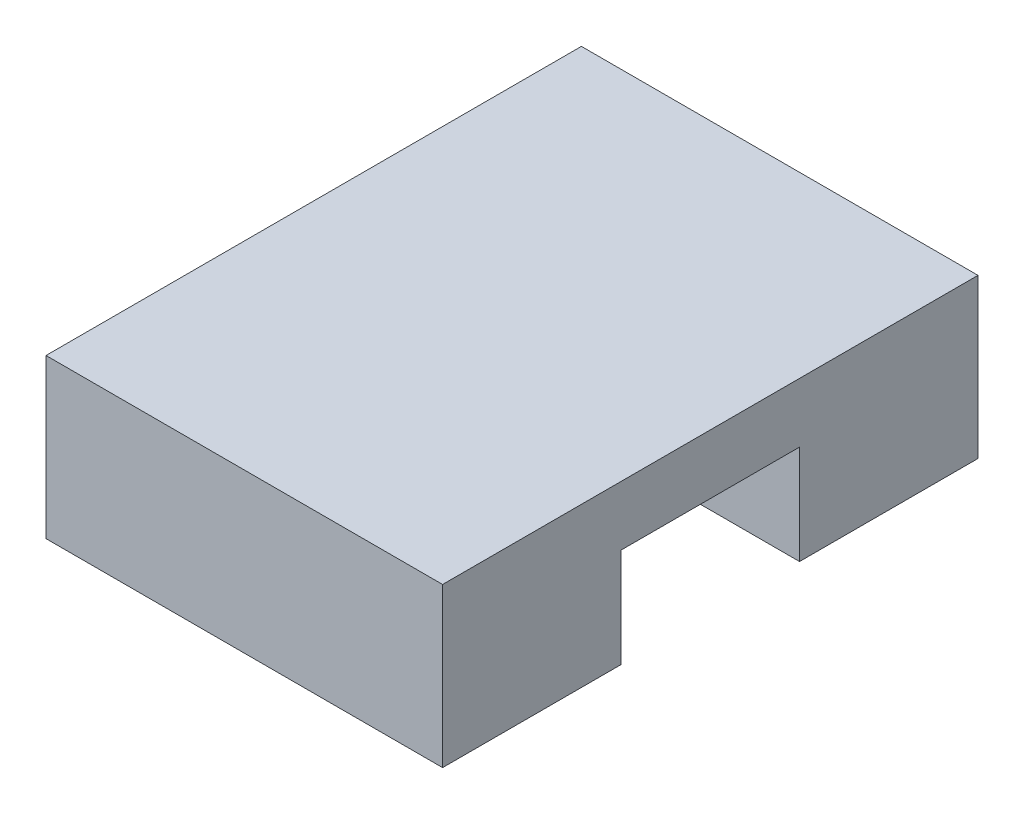
ISO-10303-21;
HEADER;
FILE_DESCRIPTION(('STEP AP214'),'2;1');
FILE_NAME('part.step','',(''),(''),'','','');
FILE_SCHEMA(('AUTOMOTIVE_DESIGN { 1 0 10303 214 1 1 1 1 }'));
ENDSEC;
DATA;
#1=APPLICATION_CONTEXT('core data for automotive mechanical design processes');
#2=APPLICATION_PROTOCOL_DEFINITION('international standard','automotive_design',2000,#1);
#3=PRODUCT_CONTEXT('',#1,'mechanical');
#4=PRODUCT('Part','Part','',(#3));
#5=PRODUCT_RELATED_PRODUCT_CATEGORY('part','',(#4));
#6=PRODUCT_DEFINITION_FORMATION('','',#4);
#7=PRODUCT_DEFINITION_CONTEXT('part definition',#1,'design');
#8=PRODUCT_DEFINITION('design','',#6,#7);
#9=PRODUCT_DEFINITION_SHAPE('','',#8);
#10=(LENGTH_UNIT() NAMED_UNIT(*) SI_UNIT(.MILLI.,.METRE.));
#11=(NAMED_UNIT(*) PLANE_ANGLE_UNIT() SI_UNIT($,.RADIAN.));
#12=(NAMED_UNIT(*) SI_UNIT($,.STERADIAN.) SOLID_ANGLE_UNIT());
#13=UNCERTAINTY_MEASURE_WITH_UNIT(LENGTH_MEASURE(1.E-05),#10,'distance_accuracy_value','');
#14=(GEOMETRIC_REPRESENTATION_CONTEXT(3) GLOBAL_UNCERTAINTY_ASSIGNED_CONTEXT((#13)) GLOBAL_UNIT_ASSIGNED_CONTEXT((#10,
#11,#12)) REPRESENTATION_CONTEXT('',''));
#15=CARTESIAN_POINT('',(0.,0.,0.));
#16=DIRECTION('',(0.,0.,1.));
#17=DIRECTION('',(1.,0.,0.));
#18=AXIS2_PLACEMENT_3D('',#15,#16,#17);
#19=CARTESIAN_POINT('',(0.,0.,0.));
#20=DIRECTION('',(0.,1.,0.));
#21=DIRECTION('',(0.,0.,1.));
#22=AXIS2_PLACEMENT_3D('',#19,#20,#21);
#23=PLANE('',#22);
#24=DIRECTION('',(0.,0.,-1.));
#25=VECTOR('',#24,1.);
#26=CARTESIAN_POINT('',(-0.903225806451618,0.,-9.87096774193548));
#27=LINE('',#26,#25);
#28=CARTESIAN_POINT('',(-0.903225806451614,0.,-0.870967741935486));
#29=VERTEX_POINT('',#28);
#30=CARTESIAN_POINT('',(-0.903225806451618,0.,-9.87096774193548));
#31=VERTEX_POINT('',#30);
#32=EDGE_CURVE('E132',#29,#31,#27,.T.);
#33=ORIENTED_EDGE('',*,*,#32,.F.);
#34=DIRECTION('',(-1.,0.,0.));
#35=VECTOR('',#34,1.);
#36=CARTESIAN_POINT('',(-0.903225806451614,0.,-0.870967741935486));
#37=LINE('',#36,#35);
#38=CARTESIAN_POINT('',(-20.9032258064516,0.,-0.870967741935484));
#39=VERTEX_POINT('',#38);
#40=EDGE_CURVE('E114',#29,#39,#37,.T.);
#41=ORIENTED_EDGE('',*,*,#40,.T.);
#42=DIRECTION('',(0.,0.,1.));
#43=VECTOR('',#42,1.);
#44=CARTESIAN_POINT('',(-20.9032258064516,0.,-9.87096774193548));
#45=LINE('',#44,#43);
#46=CARTESIAN_POINT('',(-20.9032258064516,0.,-9.87096774193548));
#47=VERTEX_POINT('',#46);
#48=EDGE_CURVE('E144',#47,#39,#45,.T.);
#49=ORIENTED_EDGE('',*,*,#48,.F.);
#50=DIRECTION('',(-1.,0.,0.));
#51=VECTOR('',#50,1.);
#52=CARTESIAN_POINT('',(-20.9032258064516,0.,-9.87096774193548));
#53=LINE('',#52,#51);
#54=EDGE_CURVE('E85',#31,#47,#53,.T.);
#55=ORIENTED_EDGE('',*,*,#54,.F.);
#56=EDGE_LOOP('',(#33,#41,#49,#55));
#57=FACE_BOUND('',#56,.T.);
#58=ADVANCED_FACE('F39',(#57),#23,.F.);
#59=CARTESIAN_POINT('',(-20.9032258064516,8.,-9.87096774193548));
#60=DIRECTION('',(1.,0.,0.));
#61=DIRECTION('',(0.,0.,-1.));
#62=AXIS2_PLACEMENT_3D('',#59,#60,#61);
#63=PLANE('',#62);
#64=ORIENTED_EDGE('',*,*,#48,.T.);
#65=DIRECTION('',(0.,-1.,0.));
#66=VECTOR('',#65,1.);
#67=CARTESIAN_POINT('',(-20.9032258064516,5.,-0.870967741935485));
#68=LINE('',#67,#66);
#69=CARTESIAN_POINT('',(-20.9032258064516,5.,-0.870967741935485));
#70=VERTEX_POINT('',#69);
#71=EDGE_CURVE('E120',#70,#39,#68,.T.);
#72=ORIENTED_EDGE('',*,*,#71,.F.);
#73=DIRECTION('',(0.,0.,-1.));
#74=VECTOR('',#73,1.);
#75=CARTESIAN_POINT('',(-20.9032258064516,5.,-0.870967741935485));
#76=LINE('',#75,#74);
#77=CARTESIAN_POINT('',(-20.9032258064516,5.,8.12903225806452));
#78=VERTEX_POINT('',#77);
#79=EDGE_CURVE('E135',#78,#70,#76,.T.);
#80=ORIENTED_EDGE('',*,*,#79,.F.);
#81=DIRECTION('',(0.,1.,0.));
#82=VECTOR('',#81,1.);
#83=CARTESIAN_POINT('',(-20.9032258064516,5.,8.12903225806452));
#84=LINE('',#83,#82);
#85=CARTESIAN_POINT('',(-20.9032258064516,0.,8.12903225806452));
#86=VERTEX_POINT('',#85);
#87=EDGE_CURVE('E192',#86,#78,#84,.T.);
#88=ORIENTED_EDGE('',*,*,#87,.F.);
#89=CARTESIAN_POINT('',(-20.9032258064516,0.,17.1290322580645));
#90=VERTEX_POINT('',#89);
#91=EDGE_CURVE('E165',#86,#90,#45,.T.);
#92=ORIENTED_EDGE('',*,*,#91,.T.);
#93=DIRECTION('',(0.,-1.,0.));
#94=VECTOR('',#93,1.);
#95=CARTESIAN_POINT('',(-20.9032258064516,8.,17.1290322580645));
#96=LINE('',#95,#94);
#97=CARTESIAN_POINT('',(-20.9032258064516,8.,17.1290322580645));
#98=VERTEX_POINT('',#97);
#99=EDGE_CURVE('E11',#98,#90,#96,.T.);
#100=ORIENTED_EDGE('',*,*,#99,.F.);
#101=DIRECTION('',(0.,0.,1.));
#102=VECTOR('',#101,1.);
#103=CARTESIAN_POINT('',(-20.9032258064516,8.,-9.87096774193548));
#104=LINE('',#103,#102);
#105=CARTESIAN_POINT('',(-20.9032258064516,8.,-9.87096774193548));
#106=VERTEX_POINT('',#105);
#107=EDGE_CURVE('E150',#106,#98,#104,.T.);
#108=ORIENTED_EDGE('',*,*,#107,.F.);
#109=DIRECTION('',(0.,-1.,0.));
#110=VECTOR('',#109,1.);
#111=CARTESIAN_POINT('',(-20.9032258064516,8.,-9.87096774193548));
#112=LINE('',#111,#110);
#113=EDGE_CURVE('E151',#106,#47,#112,.T.);
#114=ORIENTED_EDGE('',*,*,#113,.T.);
#115=EDGE_LOOP('',(#64,#72,#80,#88,#92,#100,#108,#114));
#116=FACE_BOUND('',#115,.T.);
#117=ADVANCED_FACE('F41',(#116),#63,.F.);
#118=CARTESIAN_POINT('',(-20.9032258064516,8.,17.1290322580645));
#119=DIRECTION('',(0.,0.,-1.));
#120=DIRECTION('',(-1.,0.,0.));
#121=AXIS2_PLACEMENT_3D('',#118,#119,#120);
#122=PLANE('',#121);
#123=DIRECTION('',(1.,0.,0.));
#124=VECTOR('',#123,1.);
#125=CARTESIAN_POINT('',(-20.9032258064516,0.,17.1290322580645));
#126=LINE('',#125,#124);
#127=CARTESIAN_POINT('',(-0.903225806451615,0.,17.1290322580645));
#128=VERTEX_POINT('',#127);
#129=EDGE_CURVE('E139',#90,#128,#126,.T.);
#130=ORIENTED_EDGE('',*,*,#129,.T.);
#131=DIRECTION('',(0.,-1.,0.));
#132=VECTOR('',#131,1.);
#133=CARTESIAN_POINT('',(-0.903225806451615,8.,17.1290322580645));
#134=LINE('',#133,#132);
#135=CARTESIAN_POINT('',(-0.903225806451615,8.,17.1290322580645));
#136=VERTEX_POINT('',#135);
#137=EDGE_CURVE('E48',#136,#128,#134,.T.);
#138=ORIENTED_EDGE('',*,*,#137,.F.);
#139=DIRECTION('',(1.,0.,0.));
#140=VECTOR('',#139,1.);
#141=CARTESIAN_POINT('',(-20.9032258064516,8.,17.1290322580645));
#142=LINE('',#141,#140);
#143=EDGE_CURVE('E92',#98,#136,#142,.T.);
#144=ORIENTED_EDGE('',*,*,#143,.F.);
#145=ORIENTED_EDGE('',*,*,#99,.T.);
#146=EDGE_LOOP('',(#130,#138,#144,#145));
#147=FACE_BOUND('',#146,.T.);
#148=ADVANCED_FACE('F217',(#147),#122,.F.);
#149=CARTESIAN_POINT('',(-0.903225806451618,8.,-9.87096774193548));
#150=DIRECTION('',(-1.,0.,0.));
#151=DIRECTION('',(0.,0.,1.));
#152=AXIS2_PLACEMENT_3D('',#149,#150,#151);
#153=PLANE('',#152);
#154=DIRECTION('',(0.,0.,-1.));
#155=VECTOR('',#154,1.);
#156=CARTESIAN_POINT('',(-0.903225806451614,5.,-0.870967741935487));
#157=LINE('',#156,#155);
#158=CARTESIAN_POINT('',(-0.903225806451614,5.,8.12903225806451));
#159=VERTEX_POINT('',#158);
#160=CARTESIAN_POINT('',(-0.903225806451614,5.,-0.870967741935487));
#161=VERTEX_POINT('',#160);
#162=EDGE_CURVE('E127',#159,#161,#157,.T.);
#163=ORIENTED_EDGE('',*,*,#162,.T.);
#164=DIRECTION('',(0.,-1.,0.));
#165=VECTOR('',#164,1.);
#166=CARTESIAN_POINT('',(-0.903225806451614,5.,-0.870967741935487));
#167=LINE('',#166,#165);
#168=EDGE_CURVE('E117',#161,#29,#167,.T.);
#169=ORIENTED_EDGE('',*,*,#168,.T.);
#170=ORIENTED_EDGE('',*,*,#32,.T.);
#171=DIRECTION('',(0.,-1.,0.));
#172=VECTOR('',#171,1.);
#173=CARTESIAN_POINT('',(-0.903225806451618,8.,-9.87096774193548));
#174=LINE('',#173,#172);
#175=CARTESIAN_POINT('',(-0.903225806451618,8.,-9.87096774193548));
#176=VERTEX_POINT('',#175);
#177=EDGE_CURVE('E154',#176,#31,#174,.T.);
#178=ORIENTED_EDGE('',*,*,#177,.F.);
#179=DIRECTION('',(0.,0.,-1.));
#180=VECTOR('',#179,1.);
#181=CARTESIAN_POINT('',(-0.903225806451618,8.,-9.87096774193548));
#182=LINE('',#181,#180);
#183=EDGE_CURVE('E160',#136,#176,#182,.T.);
#184=ORIENTED_EDGE('',*,*,#183,.F.);
#185=ORIENTED_EDGE('',*,*,#137,.T.);
#186=CARTESIAN_POINT('',(-0.903225806451616,0.,8.12903225806452));
#187=VERTEX_POINT('',#186);
#188=EDGE_CURVE('E138',#128,#187,#27,.T.);
#189=ORIENTED_EDGE('',*,*,#188,.T.);
#190=DIRECTION('',(0.,1.,0.));
#191=VECTOR('',#190,1.);
#192=CARTESIAN_POINT('',(-0.903225806451614,5.,8.12903225806451));
#193=LINE('',#192,#191);
#194=EDGE_CURVE('E55',#187,#159,#193,.T.);
#195=ORIENTED_EDGE('',*,*,#194,.T.);
#196=EDGE_LOOP('',(#163,#169,#170,#178,#184,#185,#189,#195));
#197=FACE_BOUND('',#196,.T.);
#198=ADVANCED_FACE('F130',(#197),#153,.F.);
#199=CARTESIAN_POINT('',(-20.9032258064516,8.,-9.87096774193548));
#200=DIRECTION('',(0.,0.,1.));
#201=DIRECTION('',(1.,0.,0.));
#202=AXIS2_PLACEMENT_3D('',#199,#200,#201);
#203=PLANE('',#202);
#204=ORIENTED_EDGE('',*,*,#54,.T.);
#205=ORIENTED_EDGE('',*,*,#113,.F.);
#206=DIRECTION('',(-1.,0.,0.));
#207=VECTOR('',#206,1.);
#208=CARTESIAN_POINT('',(-20.9032258064516,8.,-9.87096774193548));
#209=LINE('',#208,#207);
#210=EDGE_CURVE('E64',#176,#106,#209,.T.);
#211=ORIENTED_EDGE('',*,*,#210,.F.);
#212=ORIENTED_EDGE('',*,*,#177,.T.);
#213=EDGE_LOOP('',(#204,#205,#211,#212));
#214=FACE_BOUND('',#213,.T.);
#215=ADVANCED_FACE('F225',(#214),#203,.F.);
#216=CARTESIAN_POINT('',(0.,8.,0.));
#217=DIRECTION('',(0.,1.,0.));
#218=DIRECTION('',(0.,0.,1.));
#219=AXIS2_PLACEMENT_3D('',#216,#217,#218);
#220=PLANE('',#219);
#221=ORIENTED_EDGE('',*,*,#107,.T.);
#222=ORIENTED_EDGE('',*,*,#143,.T.);
#223=ORIENTED_EDGE('',*,*,#183,.T.);
#224=ORIENTED_EDGE('',*,*,#210,.T.);
#225=EDGE_LOOP('',(#221,#222,#223,#224));
#226=FACE_BOUND('',#225,.T.);
#227=ADVANCED_FACE('F221',(#226),#220,.T.);
#228=ORIENTED_EDGE('',*,*,#91,.F.);
#229=DIRECTION('',(-1.,0.,0.));
#230=VECTOR('',#229,1.);
#231=CARTESIAN_POINT('',(-0.903225806451614,0.,8.12903225806452));
#232=LINE('',#231,#230);
#233=EDGE_CURVE('E126',#187,#86,#232,.T.);
#234=ORIENTED_EDGE('',*,*,#233,.F.);
#235=ORIENTED_EDGE('',*,*,#188,.F.);
#236=ORIENTED_EDGE('',*,*,#129,.F.);
#237=EDGE_LOOP('',(#228,#234,#235,#236));
#238=FACE_BOUND('',#237,.T.);
#239=ADVANCED_FACE('F164',(#238),#23,.F.);
#240=CARTESIAN_POINT('',(-0.903225806451614,5.,-0.870967741935487));
#241=DIRECTION('',(0.,0.,-1.));
#242=DIRECTION('',(0.,1.,0.));
#243=AXIS2_PLACEMENT_3D('',#240,#241,#242);
#244=PLANE('',#243);
#245=ORIENTED_EDGE('',*,*,#71,.T.);
#246=ORIENTED_EDGE('',*,*,#40,.F.);
#247=ORIENTED_EDGE('',*,*,#168,.F.);
#248=DIRECTION('',(-1.,0.,0.));
#249=VECTOR('',#248,1.);
#250=CARTESIAN_POINT('',(-0.903225806451614,5.,-0.870967741935487));
#251=LINE('',#250,#249);
#252=EDGE_CURVE('E172',#161,#70,#251,.T.);
#253=ORIENTED_EDGE('',*,*,#252,.T.);
#254=EDGE_LOOP('',(#245,#246,#247,#253));
#255=FACE_BOUND('',#254,.T.);
#256=ADVANCED_FACE('F116',(#255),#244,.F.);
#257=CARTESIAN_POINT('',(-0.903225806451614,5.,-0.870967741935487));
#258=DIRECTION('',(0.,1.,0.));
#259=DIRECTION('',(0.,0.,1.));
#260=AXIS2_PLACEMENT_3D('',#257,#258,#259);
#261=PLANE('',#260);
#262=ORIENTED_EDGE('',*,*,#79,.T.);
#263=ORIENTED_EDGE('',*,*,#252,.F.);
#264=ORIENTED_EDGE('',*,*,#162,.F.);
#265=DIRECTION('',(-1.,0.,0.));
#266=VECTOR('',#265,1.);
#267=CARTESIAN_POINT('',(-0.903225806451614,5.,8.12903225806451));
#268=LINE('',#267,#266);
#269=EDGE_CURVE('E169',#159,#78,#268,.T.);
#270=ORIENTED_EDGE('',*,*,#269,.T.);
#271=EDGE_LOOP('',(#262,#263,#264,#270));
#272=FACE_BOUND('',#271,.T.);
#273=ADVANCED_FACE('F203',(#272),#261,.F.);
#274=CARTESIAN_POINT('',(-0.903225806451614,5.,8.12903225806451));
#275=DIRECTION('',(0.,0.,1.));
#276=DIRECTION('',(0.,-1.,0.));
#277=AXIS2_PLACEMENT_3D('',#274,#275,#276);
#278=PLANE('',#277);
#279=ORIENTED_EDGE('',*,*,#87,.T.);
#280=ORIENTED_EDGE('',*,*,#269,.F.);
#281=ORIENTED_EDGE('',*,*,#194,.F.);
#282=ORIENTED_EDGE('',*,*,#233,.T.);
#283=EDGE_LOOP('',(#279,#280,#281,#282));
#284=FACE_BOUND('',#283,.T.);
#285=ADVANCED_FACE('F201',(#284),#278,.F.);
#286=CLOSED_SHELL('',(#58,#117,#148,#198,#215,#227,#239,#256,#273,#285));
#287=MANIFOLD_SOLID_BREP('B2',#286);
#288=ADVANCED_BREP_SHAPE_REPRESENTATION('',(#18,#287),#14);
#289=SHAPE_DEFINITION_REPRESENTATION(#9,#288);
ENDSEC;
END-ISO-10303-21;
